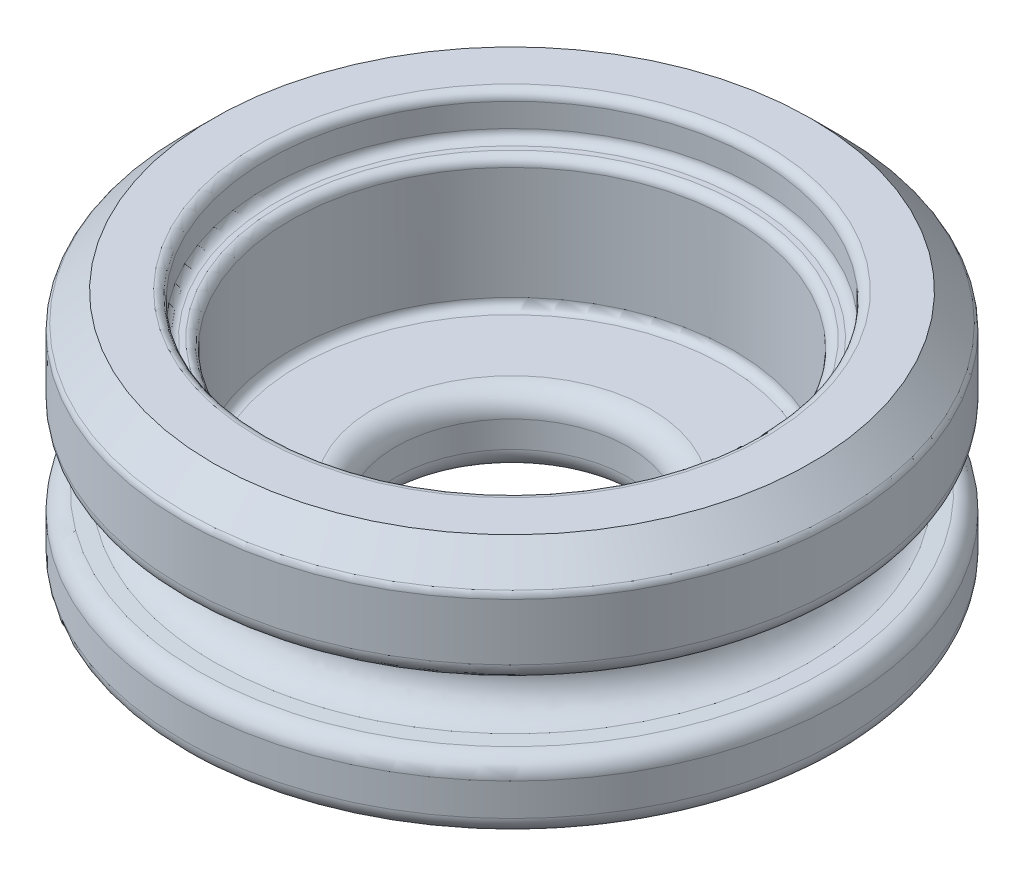
ISO-10303-21;
HEADER;
FILE_DESCRIPTION(('STEP AP214'),'2;1');
FILE_NAME('part.step','',(''),(''),'','','');
FILE_SCHEMA(('AUTOMOTIVE_DESIGN { 1 0 10303 214 1 1 1 1 }'));
ENDSEC;
DATA;
#1=APPLICATION_CONTEXT('core data for automotive mechanical design processes');
#2=APPLICATION_PROTOCOL_DEFINITION('international standard','automotive_design',2000,#1);
#3=PRODUCT_CONTEXT('',#1,'mechanical');
#4=PRODUCT('Part','Part','',(#3));
#5=PRODUCT_RELATED_PRODUCT_CATEGORY('part','',(#4));
#6=PRODUCT_DEFINITION_FORMATION('','',#4);
#7=PRODUCT_DEFINITION_CONTEXT('part definition',#1,'design');
#8=PRODUCT_DEFINITION('design','',#6,#7);
#9=PRODUCT_DEFINITION_SHAPE('','',#8);
#10=(LENGTH_UNIT() NAMED_UNIT(*) SI_UNIT(.MILLI.,.METRE.));
#11=(NAMED_UNIT(*) PLANE_ANGLE_UNIT() SI_UNIT($,.RADIAN.));
#12=(NAMED_UNIT(*) SI_UNIT($,.STERADIAN.) SOLID_ANGLE_UNIT());
#13=UNCERTAINTY_MEASURE_WITH_UNIT(LENGTH_MEASURE(1.E-05),#10,'distance_accuracy_value','');
#14=(GEOMETRIC_REPRESENTATION_CONTEXT(3) GLOBAL_UNCERTAINTY_ASSIGNED_CONTEXT((#13)) GLOBAL_UNIT_ASSIGNED_CONTEXT((#10,
#11,#12)) REPRESENTATION_CONTEXT('',''));
#15=CARTESIAN_POINT('',(0.,0.,0.));
#16=DIRECTION('',(0.,0.,1.));
#17=DIRECTION('',(1.,0.,0.));
#18=AXIS2_PLACEMENT_3D('',#15,#16,#17);
#19=CARTESIAN_POINT('',(0.,-18.1401173645597,0.));
#20=DIRECTION('',(0.,1.,0.));
#21=DIRECTION('',(0.,0.,1.));
#22=AXIS2_PLACEMENT_3D('',#19,#20,#21);
#23=CYLINDRICAL_SURFACE('',#22,6.4135);
#24=CARTESIAN_POINT('',(0.,2.286,0.));
#25=DIRECTION('',(0.,-1.,0.));
#26=DIRECTION('',(0.,0.,-1.));
#27=AXIS2_PLACEMENT_3D('',#24,#25,#26);
#28=CIRCLE('',#27,6.4135);
#29=CARTESIAN_POINT('',(0.,2.286,6.4135));
#30=VERTEX_POINT('',#29);
#31=EDGE_CURVE('E11',#30,#30,#28,.T.);
#32=CARTESIAN_POINT('',(0.,5.540375,0.));
#33=DIRECTION('',(0.,1.,0.));
#34=DIRECTION('',(0.,0.,1.));
#35=AXIS2_PLACEMENT_3D('',#32,#33,#34);
#36=CIRCLE('',#35,6.4135);
#37=CARTESIAN_POINT('',(0.,5.540375,6.4135));
#38=VERTEX_POINT('',#37);
#39=EDGE_CURVE('E108',#38,#38,#36,.T.);
#40=CARTESIAN_POINT('',(0.,2.286,6.4135));
#41=CARTESIAN_POINT('',(0.,2.31989973958334,6.4135));
#42=CARTESIAN_POINT('',(0.,2.35379947916667,6.4135));
#43=CARTESIAN_POINT('',(0.,2.42159895833334,6.4135));
#44=CARTESIAN_POINT('',(0.,2.45549869791667,6.4135));
#45=CARTESIAN_POINT('',(0.,2.52329817708334,6.4135));
#46=CARTESIAN_POINT('',(0.,2.55719791666667,6.4135));
#47=CARTESIAN_POINT('',(0.,2.62499739583334,6.4135));
#48=CARTESIAN_POINT('',(0.,2.65889713541667,6.4135));
#49=CARTESIAN_POINT('',(0.,2.72669661458334,6.4135));
#50=CARTESIAN_POINT('',(0.,2.76059635416667,6.4135));
#51=CARTESIAN_POINT('',(0.,2.82839583333334,6.4135));
#52=CARTESIAN_POINT('',(0.,2.86229557291667,6.4135));
#53=CARTESIAN_POINT('',(0.,2.93009505208334,6.4135));
#54=CARTESIAN_POINT('',(0.,2.96399479166667,6.4135));
#55=CARTESIAN_POINT('',(0.,3.03179427083334,6.4135));
#56=CARTESIAN_POINT('',(0.,3.06569401041667,6.4135));
#57=CARTESIAN_POINT('',(0.,3.13349348958334,6.4135));
#58=CARTESIAN_POINT('',(0.,3.16739322916667,6.4135));
#59=CARTESIAN_POINT('',(0.,3.23519270833334,6.4135));
#60=CARTESIAN_POINT('',(0.,3.26909244791667,6.4135));
#61=CARTESIAN_POINT('',(0.,3.33689192708334,6.4135));
#62=CARTESIAN_POINT('',(0.,3.37079166666667,6.4135));
#63=CARTESIAN_POINT('',(0.,3.43859114583334,6.4135));
#64=CARTESIAN_POINT('',(0.,3.47249088541667,6.4135));
#65=CARTESIAN_POINT('',(0.,3.54029036458334,6.4135));
#66=CARTESIAN_POINT('',(0.,3.57419010416667,6.4135));
#67=CARTESIAN_POINT('',(0.,3.64198958333334,6.4135));
#68=CARTESIAN_POINT('',(0.,3.67588932291667,6.4135));
#69=CARTESIAN_POINT('',(0.,3.74368880208334,6.4135));
#70=CARTESIAN_POINT('',(0.,3.77758854166667,6.4135));
#71=CARTESIAN_POINT('',(0.,3.84538802083333,6.4135));
#72=CARTESIAN_POINT('',(0.,3.87928776041667,6.4135));
#73=CARTESIAN_POINT('',(0.,3.94708723958334,6.4135));
#74=CARTESIAN_POINT('',(0.,3.98098697916667,6.4135));
#75=CARTESIAN_POINT('',(0.,4.04878645833334,6.4135));
#76=CARTESIAN_POINT('',(0.,4.08268619791667,6.4135));
#77=CARTESIAN_POINT('',(0.,4.15048567708333,6.4135));
#78=CARTESIAN_POINT('',(0.,4.18438541666667,6.4135));
#79=CARTESIAN_POINT('',(0.,4.25218489583333,6.4135));
#80=CARTESIAN_POINT('',(0.,4.28608463541667,6.4135));
#81=CARTESIAN_POINT('',(0.,4.35388411458334,6.4135));
#82=CARTESIAN_POINT('',(0.,4.38778385416667,6.4135));
#83=CARTESIAN_POINT('',(0.,4.45558333333334,6.4135));
#84=CARTESIAN_POINT('',(0.,4.48948307291667,6.4135));
#85=CARTESIAN_POINT('',(0.,4.55728255208333,6.4135));
#86=CARTESIAN_POINT('',(0.,4.59118229166667,6.4135));
#87=CARTESIAN_POINT('',(0.,4.65898177083333,6.4135));
#88=CARTESIAN_POINT('',(0.,4.69288151041667,6.4135));
#89=CARTESIAN_POINT('',(0.,4.76068098958333,6.4135));
#90=CARTESIAN_POINT('',(0.,4.79458072916667,6.4135));
#91=CARTESIAN_POINT('',(0.,4.86238020833333,6.4135));
#92=CARTESIAN_POINT('',(0.,4.89627994791667,6.4135));
#93=CARTESIAN_POINT('',(0.,4.96407942708333,6.4135));
#94=CARTESIAN_POINT('',(0.,4.99797916666667,6.4135));
#95=CARTESIAN_POINT('',(0.,5.06577864583333,6.4135));
#96=CARTESIAN_POINT('',(0.,5.09967838541667,6.4135));
#97=CARTESIAN_POINT('',(0.,5.16747786458333,6.4135));
#98=CARTESIAN_POINT('',(0.,5.20137760416667,6.4135));
#99=CARTESIAN_POINT('',(0.,5.26917708333333,6.4135));
#100=CARTESIAN_POINT('',(0.,5.30307682291667,6.4135));
#101=CARTESIAN_POINT('',(0.,5.37087630208333,6.4135));
#102=CARTESIAN_POINT('',(0.,5.40477604166667,6.4135));
#103=CARTESIAN_POINT('',(0.,5.47257552083333,6.4135));
#104=CARTESIAN_POINT('',(0.,5.50647526041667,6.4135));
#105=CARTESIAN_POINT('',(0.,5.540375,6.4135));
#106=B_SPLINE_CURVE_WITH_KNOTS('',3,(#40,#41,#42,#43,#44,#45,#46,#47,#48,#49,#50,#51,#52,#53,
#54,#55,#56,#57,#58,#59,#60,#61,#62,#63,#64,#65,#66,#67,#68,#69,#70,#71,#72,#73,#74,#75,#76,#77,
#78,#79,#80,#81,#82,#83,#84,#85,#86,#87,#88,#89,#90,#91,#92,#93,#94,#95,#96,#97,#98,#99,#100,
#101,#102,#103,#104,#105),.UNSPECIFIED.,.F.,.F.,(4,2,2,2,2,2,2,2,2,2,2,2,2,2,2,2,2,2,2,2,2,2,2,
2,2,2,2,2,2,2,2,2,4),(0.,0.101699218750001,0.203398437499999,0.30509765625,0.406796875000001,
0.508496093749998,0.610195312499999,0.71189453125,0.813593750000001,0.915292968749998,
1.0169921875,1.11869140625,1.220390625,1.32208984375,1.4237890625,1.52548828125,1.6271875,
1.72888671875,1.8305859375,1.93228515625,2.033984375,2.13568359375,2.2373828125,2.33908203125,
2.44078125,2.54248046875,2.6441796875,2.74587890625,2.847578125,2.94927734375,3.0509765625,
3.15267578125,3.254375),.UNSPECIFIED.);
#107=EDGE_CURVE('BSEAM40',#30,#38,#106,.T.);
#108=ORIENTED_EDGE('',*,*,#31,.T.);
#109=ORIENTED_EDGE('',*,*,#39,.T.);
#110=ORIENTED_EDGE('',*,*,#107,.T.);
#111=ORIENTED_EDGE('',*,*,#107,.F.);
#112=EDGE_LOOP('',(#108,#110,#109,#111));
#113=FACE_BOUND('',#112,.T.);
#114=ADVANCED_FACE('F40',(#113),#23,.F.);
#115=CARTESIAN_POINT('',(0.,6.985,0.));
#116=DIRECTION('',(0.,-1.,0.));
#117=DIRECTION('',(0.,0.,-1.));
#118=AXIS2_PLACEMENT_3D('',#115,#116,#117);
#119=CYLINDRICAL_SURFACE('',#118,9.525);
#120=CARTESIAN_POINT('',(0.,5.99078975515723,0.));
#121=DIRECTION('',(0.,1.,0.));
#122=DIRECTION('',(0.,0.,1.));
#123=AXIS2_PLACEMENT_3D('',#120,#121,#122);
#124=CIRCLE('',#123,9.525);
#125=CARTESIAN_POINT('',(0.,5.99078975515723,9.525));
#126=VERTEX_POINT('',#125);
#127=EDGE_CURVE('E132',#126,#126,#124,.F.);
#128=ORIENTED_EDGE('',*,*,#127,.T.);
#129=EDGE_LOOP('',(#128));
#130=FACE_BOUND('',#129,.T.);
#131=CARTESIAN_POINT('',(0.,4.35338149382732,0.));
#132=DIRECTION('',(0.,-1.,0.));
#133=DIRECTION('',(0.,0.,-1.));
#134=AXIS2_PLACEMENT_3D('',#131,#132,#133);
#135=CIRCLE('',#134,9.525);
#136=CARTESIAN_POINT('',(0.802991569326941,4.35338149382732,9.49109211521993));
#137=VERTEX_POINT('',#136);
#138=EDGE_CURVE('E111',#137,#137,#135,.F.);
#139=ORIENTED_EDGE('',*,*,#138,.T.);
#140=EDGE_LOOP('',(#139));
#141=FACE_BOUND('',#140,.T.);
#142=ADVANCED_FACE('F165',(#130,#141),#119,.T.);
#143=CARTESIAN_POINT('',(0.,1.44536115566649,0.));
#144=DIRECTION('',(0.,-1.,0.));
#145=DIRECTION('',(0.,0.,-1.));
#146=AXIS2_PLACEMENT_3D('',#143,#144,#145);
#147=CIRCLE('',#146,9.525);
#148=CARTESIAN_POINT('',(0.802597957528907,1.44536115566649,9.49112540843131));
#149=VERTEX_POINT('',#148);
#150=EDGE_CURVE('E121',#149,#149,#147,.T.);
#151=ORIENTED_EDGE('',*,*,#150,.T.);
#152=EDGE_LOOP('',(#151));
#153=FACE_BOUND('',#152,.T.);
#154=CARTESIAN_POINT('',(0.,0.508,0.));
#155=DIRECTION('',(0.,1.,0.));
#156=DIRECTION('',(0.,0.,1.));
#157=AXIS2_PLACEMENT_3D('',#154,#155,#156);
#158=CIRCLE('',#157,9.525);
#159=CARTESIAN_POINT('',(0.,0.508,9.525));
#160=VERTEX_POINT('',#159);
#161=EDGE_CURVE('E118',#160,#160,#158,.T.);
#162=ORIENTED_EDGE('',*,*,#161,.T.);
#163=EDGE_LOOP('',(#162));
#164=FACE_BOUND('',#163,.T.);
#165=ADVANCED_FACE('F171',(#153,#164),#119,.T.);
#166=CARTESIAN_POINT('',(0.,6.985,0.));
#167=DIRECTION('',(0.,1.,0.));
#168=DIRECTION('',(0.,0.,1.));
#169=AXIS2_PLACEMENT_3D('',#166,#167,#168);
#170=PLANE('',#169);
#171=CARTESIAN_POINT('',(0.,6.985,0.));
#172=DIRECTION('',(0.,1.,0.));
#173=DIRECTION('',(0.,0.,1.));
#174=AXIS2_PLACEMENT_3D('',#171,#172,#173);
#175=CIRCLE('',#174,8.636);
#176=CARTESIAN_POINT('',(0.,6.985,8.636));
#177=VERTEX_POINT('',#176);
#178=EDGE_CURVE('E127',#177,#177,#175,.T.);
#179=ORIENTED_EDGE('',*,*,#178,.T.);
#180=EDGE_LOOP('',(#179));
#181=FACE_BOUND('',#180,.T.);
#182=CARTESIAN_POINT('',(0.,6.985,0.));
#183=DIRECTION('',(0.,1.,0.));
#184=DIRECTION('',(0.,0.,1.));
#185=AXIS2_PLACEMENT_3D('',#182,#183,#184);
#186=CIRCLE('',#185,7.3263125);
#187=CARTESIAN_POINT('',(0.,6.985,7.3263125));
#188=VERTEX_POINT('',#187);
#189=EDGE_CURVE('E99',#188,#188,#186,.F.);
#190=ORIENTED_EDGE('',*,*,#189,.T.);
#191=EDGE_LOOP('',(#190));
#192=FACE_BOUND('',#191,.T.);
#193=ADVANCED_FACE('F179',(#181,#192),#170,.T.);
#194=CARTESIAN_POINT('',(0.,0.,0.));
#195=DIRECTION('',(0.,1.,0.));
#196=DIRECTION('',(0.,0.,1.));
#197=AXIS2_PLACEMENT_3D('',#194,#195,#196);
#198=PLANE('',#197);
#199=CARTESIAN_POINT('',(0.,0.,0.));
#200=DIRECTION('',(0.,1.,0.));
#201=DIRECTION('',(0.,0.,1.));
#202=AXIS2_PLACEMENT_3D('',#199,#200,#201);
#203=CIRCLE('',#202,4.0005);
#204=CARTESIAN_POINT('',(0.,0.,4.0005));
#205=VERTEX_POINT('',#204);
#206=EDGE_CURVE('E147',#205,#205,#203,.T.);
#207=ORIENTED_EDGE('',*,*,#206,.T.);
#208=EDGE_LOOP('',(#207));
#209=FACE_BOUND('',#208,.T.);
#210=CARTESIAN_POINT('',(0.,0.,0.));
#211=DIRECTION('',(0.,1.,0.));
#212=DIRECTION('',(0.,0.,1.));
#213=AXIS2_PLACEMENT_3D('',#210,#211,#212);
#214=CIRCLE('',#213,9.017);
#215=CARTESIAN_POINT('',(0.,0.,9.017));
#216=VERTEX_POINT('',#215);
#217=EDGE_CURVE('E124',#216,#216,#214,.F.);
#218=ORIENTED_EDGE('',*,*,#217,.T.);
#219=EDGE_LOOP('',(#218));
#220=FACE_BOUND('',#219,.T.);
#221=ADVANCED_FACE('F182',(#209,#220),#198,.F.);
#222=CARTESIAN_POINT('',(0.,5.794375,0.));
#223=DIRECTION('',(0.,1.,0.));
#224=DIRECTION('',(0.,0.,1.));
#225=AXIS2_PLACEMENT_3D('',#222,#223,#224);
#226=PLANE('',#225);
#227=CARTESIAN_POINT('',(0.,5.794375,0.));
#228=DIRECTION('',(0.,1.,0.));
#229=DIRECTION('',(0.,0.,1.));
#230=AXIS2_PLACEMENT_3D('',#227,#228,#229);
#231=CIRCLE('',#230,6.8183125);
#232=CARTESIAN_POINT('',(0.,5.794375,6.8183125));
#233=VERTEX_POINT('',#232);
#234=EDGE_CURVE('E105',#233,#233,#231,.T.);
#235=ORIENTED_EDGE('',*,*,#234,.T.);
#236=EDGE_LOOP('',(#235));
#237=FACE_BOUND('',#236,.T.);
#238=CARTESIAN_POINT('',(0.,5.794375,0.));
#239=DIRECTION('',(0.,1.,0.));
#240=DIRECTION('',(0.,0.,1.));
#241=AXIS2_PLACEMENT_3D('',#238,#239,#240);
#242=CIRCLE('',#241,6.6675);
#243=CARTESIAN_POINT('',(0.,5.794375,6.6675));
#244=VERTEX_POINT('',#243);
#245=EDGE_CURVE('E102',#244,#244,#242,.F.);
#246=ORIENTED_EDGE('',*,*,#245,.T.);
#247=EDGE_LOOP('',(#246));
#248=FACE_BOUND('',#247,.T.);
#249=ADVANCED_FACE('F185',(#237,#248),#226,.T.);
#250=CARTESIAN_POINT('',(0.,5.794375,0.));
#251=DIRECTION('',(0.,1.,0.));
#252=DIRECTION('',(0.,0.,1.));
#253=AXIS2_PLACEMENT_3D('',#250,#251,#252);
#254=CYLINDRICAL_SURFACE('',#253,7.0723125);
#255=CARTESIAN_POINT('',(0.,6.731,0.));
#256=DIRECTION('',(0.,1.,0.));
#257=DIRECTION('',(0.,0.,1.));
#258=AXIS2_PLACEMENT_3D('',#255,#256,#257);
#259=CIRCLE('',#258,7.0723125);
#260=CARTESIAN_POINT('',(0.,6.731,7.0723125));
#261=VERTEX_POINT('',#260);
#262=EDGE_CURVE('E96',#261,#261,#259,.T.);
#263=CARTESIAN_POINT('',(0.,6.048375,0.));
#264=DIRECTION('',(0.,1.,0.));
#265=DIRECTION('',(0.,0.,1.));
#266=AXIS2_PLACEMENT_3D('',#263,#264,#265);
#267=CIRCLE('',#266,7.0723125);
#268=CARTESIAN_POINT('',(0.,6.048375,7.0723125));
#269=VERTEX_POINT('',#268);
#270=EDGE_CURVE('E88',#269,#269,#267,.F.);
#271=CARTESIAN_POINT('',(0.,6.731,7.0723125));
#272=CARTESIAN_POINT('',(0.,6.72388932291667,7.0723125));
#273=CARTESIAN_POINT('',(0.,6.71677864583333,7.0723125));
#274=CARTESIAN_POINT('',(0.,6.70255729166667,7.0723125));
#275=CARTESIAN_POINT('',(0.,6.69544661458333,7.0723125));
#276=CARTESIAN_POINT('',(0.,6.68122526041667,7.0723125));
#277=CARTESIAN_POINT('',(0.,6.67411458333333,7.0723125));
#278=CARTESIAN_POINT('',(0.,6.65989322916667,7.0723125));
#279=CARTESIAN_POINT('',(0.,6.65278255208333,7.0723125));
#280=CARTESIAN_POINT('',(0.,6.63856119791667,7.0723125));
#281=CARTESIAN_POINT('',(0.,6.63145052083333,7.0723125));
#282=CARTESIAN_POINT('',(0.,6.61722916666667,7.0723125));
#283=CARTESIAN_POINT('',(0.,6.61011848958333,7.0723125));
#284=CARTESIAN_POINT('',(0.,6.59589713541667,7.0723125));
#285=CARTESIAN_POINT('',(0.,6.58878645833333,7.0723125));
#286=CARTESIAN_POINT('',(0.,6.57456510416667,7.0723125));
#287=CARTESIAN_POINT('',(0.,6.56745442708333,7.0723125));
#288=CARTESIAN_POINT('',(0.,6.55323307291667,7.0723125));
#289=CARTESIAN_POINT('',(0.,6.54612239583333,7.0723125));
#290=CARTESIAN_POINT('',(0.,6.53190104166667,7.0723125));
#291=CARTESIAN_POINT('',(0.,6.52479036458333,7.0723125));
#292=CARTESIAN_POINT('',(0.,6.51056901041667,7.0723125));
#293=CARTESIAN_POINT('',(0.,6.50345833333333,7.0723125));
#294=CARTESIAN_POINT('',(0.,6.48923697916667,7.0723125));
#295=CARTESIAN_POINT('',(0.,6.48212630208333,7.0723125));
#296=CARTESIAN_POINT('',(0.,6.46790494791667,7.0723125));
#297=CARTESIAN_POINT('',(0.,6.46079427083333,7.0723125));
#298=CARTESIAN_POINT('',(0.,6.44657291666667,7.0723125));
#299=CARTESIAN_POINT('',(0.,6.43946223958333,7.0723125));
#300=CARTESIAN_POINT('',(0.,6.42524088541667,7.0723125));
#301=CARTESIAN_POINT('',(0.,6.41813020833333,7.0723125));
#302=CARTESIAN_POINT('',(0.,6.40390885416667,7.0723125));
#303=CARTESIAN_POINT('',(0.,6.39679817708333,7.0723125));
#304=CARTESIAN_POINT('',(0.,6.38257682291667,7.0723125));
#305=CARTESIAN_POINT('',(0.,6.37546614583333,7.0723125));
#306=CARTESIAN_POINT('',(0.,6.36124479166667,7.0723125));
#307=CARTESIAN_POINT('',(0.,6.35413411458333,7.0723125));
#308=CARTESIAN_POINT('',(0.,6.33991276041667,7.0723125));
#309=CARTESIAN_POINT('',(0.,6.33280208333333,7.0723125));
#310=CARTESIAN_POINT('',(0.,6.31858072916667,7.0723125));
#311=CARTESIAN_POINT('',(0.,6.31147005208333,7.0723125));
#312=CARTESIAN_POINT('',(0.,6.29724869791667,7.0723125));
#313=CARTESIAN_POINT('',(0.,6.29013802083333,7.0723125));
#314=CARTESIAN_POINT('',(0.,6.27591666666667,7.0723125));
#315=CARTESIAN_POINT('',(0.,6.26880598958333,7.0723125));
#316=CARTESIAN_POINT('',(0.,6.25458463541667,7.0723125));
#317=CARTESIAN_POINT('',(0.,6.24747395833333,7.0723125));
#318=CARTESIAN_POINT('',(0.,6.23325260416667,7.0723125));
#319=CARTESIAN_POINT('',(0.,6.22614192708333,7.0723125));
#320=CARTESIAN_POINT('',(0.,6.21192057291667,7.0723125));
#321=CARTESIAN_POINT('',(0.,6.20480989583333,7.0723125));
#322=CARTESIAN_POINT('',(0.,6.19058854166667,7.0723125));
#323=CARTESIAN_POINT('',(0.,6.18347786458333,7.0723125));
#324=CARTESIAN_POINT('',(0.,6.16925651041667,7.0723125));
#325=CARTESIAN_POINT('',(0.,6.16214583333333,7.0723125));
#326=CARTESIAN_POINT('',(0.,6.14792447916667,7.0723125));
#327=CARTESIAN_POINT('',(0.,6.14081380208333,7.0723125));
#328=CARTESIAN_POINT('',(0.,6.12659244791667,7.0723125));
#329=CARTESIAN_POINT('',(0.,6.11948177083333,7.0723125));
#330=CARTESIAN_POINT('',(0.,6.10526041666667,7.0723125));
#331=CARTESIAN_POINT('',(0.,6.09814973958333,7.0723125));
#332=CARTESIAN_POINT('',(0.,6.08392838541667,7.0723125));
#333=CARTESIAN_POINT('',(0.,6.07681770833333,7.0723125));
#334=CARTESIAN_POINT('',(0.,6.06259635416667,7.0723125));
#335=CARTESIAN_POINT('',(0.,6.05548567708333,7.0723125));
#336=CARTESIAN_POINT('',(0.,6.048375,7.0723125));
#337=B_SPLINE_CURVE_WITH_KNOTS('',3,(#271,#272,#273,#274,#275,#276,#277,#278,#279,#280,#281,
#282,#283,#284,#285,#286,#287,#288,#289,#290,#291,#292,#293,#294,#295,#296,#297,#298,#299,#300,
#301,#302,#303,#304,#305,#306,#307,#308,#309,#310,#311,#312,#313,#314,#315,#316,#317,#318,#319,
#320,#321,#322,#323,#324,#325,#326,#327,#328,#329,#330,#331,#332,#333,#334,#335,#336),
.UNSPECIFIED.,.F.,.F.,(4,2,2,2,2,2,2,2,2,2,2,2,2,2,2,2,2,2,2,2,2,2,2,2,2,2,2,2,2,2,2,2,4),(0.,
0.0213320312499998,0.0426640624999995,0.0639960937500001,0.0853281249999999,0.10666015625,
0.127992187499999,0.14932421875,0.17065625,0.19198828125,0.213320312499999,0.23465234375,
0.255984375,0.277316406249999,0.298648437499999,0.31998046875,0.3413125,0.362644531249999,
0.3839765625,0.40530859375,0.426640624999999,0.447972656249999,0.4693046875,0.49063671875,
0.511968749999999,0.533300781249999,0.5546328125,0.57596484375,0.597296874999999,0.61862890625,
0.6399609375,0.661292968749999,0.682624999999999),.UNSPECIFIED.);
#338=EDGE_CURVE('BSEAM177',#261,#269,#337,.T.);
#339=ORIENTED_EDGE('',*,*,#262,.T.);
#340=ORIENTED_EDGE('',*,*,#270,.T.);
#341=ORIENTED_EDGE('',*,*,#338,.T.);
#342=ORIENTED_EDGE('',*,*,#338,.F.);
#343=EDGE_LOOP('',(#339,#341,#340,#342));
#344=FACE_BOUND('',#343,.T.);
#345=ADVANCED_FACE('F177',(#344),#254,.F.);
#346=CARTESIAN_POINT('',(0.760529971451931,3.84160667122113,8.54210164457974));
#347=CARTESIAN_POINT('',(17.8447332606114,3.84160667122113,7.02104170167588));
#348=CARTESIAN_POINT('',(16.3236733177075,3.84160667122113,-10.0631615874836));
#349=CARTESIAN_POINT('',(-0.760529971451931,3.84160667122113,-8.54210164457974));
#350=CARTESIAN_POINT('',(-17.8447332606114,3.84160667122113,-7.02104170167588));
#351=CARTESIAN_POINT('',(-16.3236733177075,3.84160667122113,10.0631615874836));
#352=CARTESIAN_POINT('',(0.760529971451931,3.84160667122113,8.54210164457974));
#353=CARTESIAN_POINT('',(0.760529971451931,3.8496875,9.49458894120874));
#354=CARTESIAN_POINT('',(19.7497078538694,3.8496875,7.97352899830488));
#355=CARTESIAN_POINT('',(18.2286479109656,3.8496875,-11.0156488841126));
#356=CARTESIAN_POINT('',(-0.760529971451931,3.8496875,-9.49458894120874));
#357=CARTESIAN_POINT('',(-19.7497078538694,3.8496875,-7.97352899830488));
#358=CARTESIAN_POINT('',(-18.2286479109656,3.8496875,11.0156488841126));
#359=CARTESIAN_POINT('',(0.760529971451931,3.8496875,9.49458894120874));
#360=(BOUNDED_SURFACE() B_SPLINE_SURFACE(1,3,((#346,#347,#348,#349,#350,#351,#352),(#353,#354,
#355,#356,#357,#358,#359)),.UNSPECIFIED.,.F.,.T.,.F.) B_SPLINE_SURFACE_WITH_KNOTS((2,2),(4,3,4),
(0.,1.),(0.,0.5,1.),
.UNSPECIFIED.) GEOMETRIC_REPRESENTATION_ITEM() RATIONAL_B_SPLINE_SURFACE(((1.,0.333333333333333,
0.333333333333333,1.,0.333333333333333,0.333333333333333,1.),(1.,0.333333333333333,
0.333333333333333,1.,0.333333333333333,0.333333333333333,1.))) REPRESENTATION_ITEM('') SURFACE());
#361=DIRECTION('',(0.,0.0084836175836416,0.999964013468832));
#362=VECTOR('',#361,1.);
#363=CARTESIAN_POINT('',(0.760529971451931,3.84160667122113,8.54210164457974));
#364=LINE('',#363,#362);
#365=CARTESIAN_POINT('',(0.760529971451931,3.84160667122113,8.54210164457973));
#366=VERTEX_POINT('',#365);
#367=CARTESIAN_POINT('',(0.760529971451931,3.84539990583393,8.98921021236391));
#368=VERTEX_POINT('',#367);
#369=EDGE_CURVE('E86',#366,#368,#364,.T.);
#370=CARTESIAN_POINT('',(0.,3.84539990583393,0.));
#371=DIRECTION('',(0.,1.,0.));
#372=DIRECTION('',(0.,0.,1.));
#373=AXIS2_PLACEMENT_3D('',#370,#371,#372);
#374=CIRCLE('',#373,9.02132507337721);
#375=EDGE_CURVE('E114',#368,#368,#374,.F.);
#376=CARTESIAN_POINT('',(0.,3.84160667122113,0.));
#377=DIRECTION('',(0.,1.,0.));
#378=DIRECTION('',(0.0886823272321617,0.,0.996059960462566));
#379=AXIS2_PLACEMENT_3D('',#376,#377,#378);
#380=CIRCLE('',#379,8.57589099416547);
#381=EDGE_CURVE('E85',#366,#366,#380,.T.);
#382=ORIENTED_EDGE('',*,*,#369,.T.);
#383=ORIENTED_EDGE('',*,*,#375,.T.);
#384=ORIENTED_EDGE('',*,*,#369,.F.);
#385=ORIENTED_EDGE('',*,*,#381,.T.);
#386=EDGE_LOOP('',(#382,#383,#384,#385));
#387=FACE_BOUND('',#386,.T.);
#388=ADVANCED_FACE('F253',(#387),#360,.F.);
#389=CARTESIAN_POINT('',(0.760529971451931,1.96103635974386,8.54210164457974));
#390=CARTESIAN_POINT('',(17.8447332606114,1.96103635974386,7.02104170167588));
#391=CARTESIAN_POINT('',(16.3236733177075,1.96103635974386,-10.0631615874836));
#392=CARTESIAN_POINT('',(-0.760529971451931,1.96103635974386,-8.54210164457974));
#393=CARTESIAN_POINT('',(-17.8447332606114,1.96103635974386,-7.02104170167588));
#394=CARTESIAN_POINT('',(-16.3236733177075,1.96103635974386,10.0631615874836));
#395=CARTESIAN_POINT('',(0.760529971451931,1.96103635974386,8.54210164457974));
#396=CARTESIAN_POINT('',(0.760529971451931,2.18859072060016,7.1349201506886));
#397=CARTESIAN_POINT('',(15.0303702728291,2.18859072060016,5.61386020778474));
#398=CARTESIAN_POINT('',(13.5093103299253,2.18859072060016,-8.65598009359246));
#399=CARTESIAN_POINT('',(-0.760529971451931,2.18859072060016,-7.1349201506886));
#400=CARTESIAN_POINT('',(-15.0303702728291,2.18859072060016,-5.61386020778474));
#401=CARTESIAN_POINT('',(-13.5093103299253,2.18859072060016,8.65598009359246));
#402=CARTESIAN_POINT('',(0.760529971451931,2.18859072060016,7.1349201506886));
#403=CARTESIAN_POINT('',(0.760529971451931,3.61405231036483,7.1349201506886));
#404=CARTESIAN_POINT('',(15.0303702728291,3.61405231036483,5.61386020778474));
#405=CARTESIAN_POINT('',(13.5093103299253,3.61405231036483,-8.65598009359246));
#406=CARTESIAN_POINT('',(-0.760529971451931,3.61405231036483,-7.1349201506886));
#407=CARTESIAN_POINT('',(-15.0303702728291,3.61405231036483,-5.61386020778474));
#408=CARTESIAN_POINT('',(-13.5093103299253,3.61405231036483,8.65598009359246));
#409=CARTESIAN_POINT('',(0.760529971451931,3.61405231036483,7.1349201506886));
#410=CARTESIAN_POINT('',(0.760529971451931,3.84160667122113,8.54210164457974));
#411=CARTESIAN_POINT('',(17.8447332606114,3.84160667122113,7.02104170167588));
#412=CARTESIAN_POINT('',(16.3236733177075,3.84160667122113,-10.0631615874836));
#413=CARTESIAN_POINT('',(-0.760529971451931,3.84160667122113,-8.54210164457974));
#414=CARTESIAN_POINT('',(-17.8447332606114,3.84160667122113,-7.02104170167588));
#415=CARTESIAN_POINT('',(-16.3236733177075,3.84160667122113,10.0631615874836));
#416=CARTESIAN_POINT('',(0.760529971451931,3.84160667122113,8.54210164457974));
#417=(BOUNDED_SURFACE() B_SPLINE_SURFACE(3,3,((#389,#390,#391,#392,#393,#394,#395),(#396,#397,
#398,#399,#400,#401,#402),(#403,#404,#405,#406,#407,#408,#409),(#410,#411,#412,#413,#414,#415,
#416)),.UNSPECIFIED.,.F.,.T.,.F.) B_SPLINE_SURFACE_WITH_KNOTS((4,4),(4,3,4),(0.,1.),(0.,0.5,1.),
.UNSPECIFIED.) GEOMETRIC_REPRESENTATION_ITEM() RATIONAL_B_SPLINE_SURFACE(((1.,0.333333333333333,
0.333333333333333,1.,0.333333333333333,0.333333333333333,1.),(0.439757040802419,
0.146585680267473,0.146585680267473,0.439757040802419,0.146585680267473,0.146585680267473,
0.439757040802419),(0.439757040802419,0.146585680267473,0.146585680267473,0.439757040802419,
0.146585680267473,0.146585680267473,0.439757040802419),(1.,0.333333333333333,0.333333333333333,
1.,0.333333333333333,0.333333333333333,1.))) REPRESENTATION_ITEM('') SURFACE());
#418=CARTESIAN_POINT('',(0.760529971451931,2.90132151548249,8.69415451662619));
#419=DIRECTION('',(1.,0.,0.));
#420=DIRECTION('',(0.,0.,-1.));
#421=AXIS2_PLACEMENT_3D('',#418,#419,#420);
#422=CIRCLE('',#421,0.9525);
#423=CARTESIAN_POINT('',(0.760529971451931,1.96103635974386,8.54210164457973));
#424=VERTEX_POINT('',#423);
#425=EDGE_CURVE('E78',#424,#366,#422,.T.);
#426=CARTESIAN_POINT('',(0.,1.96103635974386,0.));
#427=DIRECTION('',(0.,1.,0.));
#428=DIRECTION('',(0.0886823272321617,0.,0.996059960462566));
#429=AXIS2_PLACEMENT_3D('',#426,#427,#428);
#430=CIRCLE('',#429,8.57589099416547);
#431=EDGE_CURVE('E75',#424,#424,#430,.T.);
#432=ORIENTED_EDGE('',*,*,#425,.T.);
#433=ORIENTED_EDGE('',*,*,#381,.F.);
#434=ORIENTED_EDGE('',*,*,#425,.F.);
#435=ORIENTED_EDGE('',*,*,#431,.T.);
#436=EDGE_LOOP('',(#432,#433,#434,#435));
#437=FACE_BOUND('',#436,.T.);
#438=ADVANCED_FACE('F83',(#437),#417,.F.);
#439=CARTESIAN_POINT('',(0.760529971451931,1.9446875,9.49458894120874));
#440=CARTESIAN_POINT('',(19.7497078538694,1.9446875,7.97352899830488));
#441=CARTESIAN_POINT('',(18.2286479109656,1.9446875,-11.0156488841126));
#442=CARTESIAN_POINT('',(-0.760529971451931,1.9446875,-9.49458894120874));
#443=CARTESIAN_POINT('',(-19.7497078538694,1.9446875,-7.97352899830488));
#444=CARTESIAN_POINT('',(-18.2286479109656,1.9446875,11.0156488841126));
#445=CARTESIAN_POINT('',(0.760529971451931,1.9446875,9.49458894120874));
#446=CARTESIAN_POINT('',(0.760529971451931,1.96103635974386,8.54210164457974));
#447=CARTESIAN_POINT('',(17.8447332606114,1.96103635974386,7.02104170167588));
#448=CARTESIAN_POINT('',(16.3236733177075,1.96103635974386,-10.0631615874836));
#449=CARTESIAN_POINT('',(-0.760529971451931,1.96103635974386,-8.54210164457974));
#450=CARTESIAN_POINT('',(-17.8447332606114,1.96103635974386,-7.02104170167588));
#451=CARTESIAN_POINT('',(-16.3236733177075,1.96103635974386,10.0631615874836));
#452=CARTESIAN_POINT('',(0.760529971451931,1.96103635974386,8.54210164457974));
#453=(BOUNDED_SURFACE() B_SPLINE_SURFACE(1,3,((#439,#440,#441,#442,#443,#444,#445),(#446,#447,
#448,#449,#450,#451,#452)),.UNSPECIFIED.,.F.,.T.,.F.) B_SPLINE_SURFACE_WITH_KNOTS((2,2),(4,3,4),
(0.,1.),(0.,0.5,1.),
.UNSPECIFIED.) GEOMETRIC_REPRESENTATION_ITEM() RATIONAL_B_SPLINE_SURFACE(((1.,0.333333333333333,
0.333333333333333,1.,0.333333333333333,0.333333333333333,1.),(1.,0.333333333333333,
0.333333333333333,1.,0.333333333333333,0.333333333333333,1.))) REPRESENTATION_ITEM('') SURFACE());
#454=DIRECTION('',(0.,0.0171618582364967,-0.999852724465894));
#455=VECTOR('',#454,1.);
#456=CARTESIAN_POINT('',(0.760529971451931,1.9446875,9.49458894120874));
#457=LINE('',#456,#455);
#458=CARTESIAN_POINT('',(0.760529971451931,1.95328580481269,8.99365026811818));
#459=VERTEX_POINT('',#458);
#460=EDGE_CURVE('E72',#459,#424,#457,.T.);
#461=CARTESIAN_POINT('',(0.,1.95328580481269,0.));
#462=DIRECTION('',(0.,1.,0.));
#463=DIRECTION('',(0.,0.,1.));
#464=AXIS2_PLACEMENT_3D('',#461,#462,#463);
#465=CIRCLE('',#464,9.02574933081453);
#466=EDGE_CURVE('E77',#459,#459,#465,.T.);
#467=ORIENTED_EDGE('',*,*,#460,.F.);
#468=ORIENTED_EDGE('',*,*,#466,.T.);
#469=ORIENTED_EDGE('',*,*,#460,.T.);
#470=ORIENTED_EDGE('',*,*,#431,.F.);
#471=EDGE_LOOP('',(#467,#468,#469,#470));
#472=FACE_BOUND('',#471,.T.);
#473=ADVANCED_FACE('F74',(#472),#453,.F.);
#474=CARTESIAN_POINT('',(0.,2.032,0.));
#475=DIRECTION('',(0.,-1.,0.));
#476=DIRECTION('',(0.,0.,-1.));
#477=AXIS2_PLACEMENT_3D('',#474,#475,#476);
#478=PLANE('',#477);
#479=CARTESIAN_POINT('',(0.,2.032,0.));
#480=DIRECTION('',(0.,-1.,0.));
#481=DIRECTION('',(0.,0.,-1.));
#482=AXIS2_PLACEMENT_3D('',#479,#480,#481);
#483=CIRCLE('',#482,6.1595);
#484=CARTESIAN_POINT('',(0.,2.032,-6.1595));
#485=VERTEX_POINT('',#484);
#486=EDGE_CURVE('E48',#485,#485,#483,.F.);
#487=ORIENTED_EDGE('',*,*,#486,.T.);
#488=EDGE_LOOP('',(#487));
#489=FACE_BOUND('',#488,.T.);
#490=CARTESIAN_POINT('',(0.,2.032,0.));
#491=DIRECTION('',(0.,-1.,0.));
#492=DIRECTION('',(0.,0.,-1.));
#493=AXIS2_PLACEMENT_3D('',#490,#491,#492);
#494=CIRCLE('',#493,4.0005);
#495=CARTESIAN_POINT('',(0.,2.032,-4.0005));
#496=VERTEX_POINT('',#495);
#497=EDGE_CURVE('E138',#496,#496,#494,.T.);
#498=ORIENTED_EDGE('',*,*,#497,.T.);
#499=EDGE_LOOP('',(#498));
#500=FACE_BOUND('',#499,.T.);
#501=ADVANCED_FACE('F152',(#489,#500),#478,.F.);
#502=CARTESIAN_POINT('',(0.,2.032,0.));
#503=DIRECTION('',(0.,-1.,0.));
#504=DIRECTION('',(0.,0.,-1.));
#505=AXIS2_PLACEMENT_3D('',#502,#503,#504);
#506=CYLINDRICAL_SURFACE('',#505,3.3655);
#507=CARTESIAN_POINT('',(0.,1.397,0.));
#508=DIRECTION('',(0.,-1.,0.));
#509=DIRECTION('',(0.,0.,-1.));
#510=AXIS2_PLACEMENT_3D('',#507,#508,#509);
#511=CIRCLE('',#510,3.3655);
#512=CARTESIAN_POINT('',(0.,1.397,-3.3655));
#513=VERTEX_POINT('',#512);
#514=EDGE_CURVE('E144',#513,#513,#511,.F.);
#515=ORIENTED_EDGE('',*,*,#514,.T.);
#516=EDGE_LOOP('',(#515));
#517=FACE_BOUND('',#516,.T.);
#518=CARTESIAN_POINT('',(0.,0.635,0.));
#519=DIRECTION('',(0.,1.,0.));
#520=DIRECTION('',(0.,0.,1.));
#521=AXIS2_PLACEMENT_3D('',#518,#519,#520);
#522=CIRCLE('',#521,3.3655);
#523=CARTESIAN_POINT('',(0.,0.635,3.3655));
#524=VERTEX_POINT('',#523);
#525=EDGE_CURVE('E141',#524,#524,#522,.F.);
#526=ORIENTED_EDGE('',*,*,#525,.T.);
#527=EDGE_LOOP('',(#526));
#528=FACE_BOUND('',#527,.T.);
#529=ADVANCED_FACE('F194',(#517,#528),#506,.F.);
#530=CARTESIAN_POINT('',(0.,6.731,0.));
#531=DIRECTION('',(0.,1.,0.));
#532=DIRECTION('',(0.,0.,1.));
#533=AXIS2_PLACEMENT_3D('',#530,#531,#532);
#534=TOROIDAL_SURFACE('',#533,7.3263125,0.254);
#535=ORIENTED_EDGE('',*,*,#189,.F.);
#536=EDGE_LOOP('',(#535));
#537=FACE_BOUND('',#536,.T.);
#538=ORIENTED_EDGE('',*,*,#262,.F.);
#539=EDGE_LOOP('',(#538));
#540=FACE_BOUND('',#539,.T.);
#541=ADVANCED_FACE('F190',(#537,#540),#534,.T.);
#542=CARTESIAN_POINT('',(0.,6.048375,0.));
#543=DIRECTION('',(0.,1.,0.));
#544=DIRECTION('',(0.,0.,1.));
#545=AXIS2_PLACEMENT_3D('',#542,#543,#544);
#546=TOROIDAL_SURFACE('',#545,6.8183125,0.254);
#547=ORIENTED_EDGE('',*,*,#270,.F.);
#548=EDGE_LOOP('',(#547));
#549=FACE_BOUND('',#548,.T.);
#550=ORIENTED_EDGE('',*,*,#234,.F.);
#551=EDGE_LOOP('',(#550));
#552=FACE_BOUND('',#551,.T.);
#553=ADVANCED_FACE('F193',(#549,#552),#546,.F.);
#554=CARTESIAN_POINT('',(0.,5.540375,0.));
#555=DIRECTION('',(0.,1.,0.));
#556=DIRECTION('',(0.,0.,1.));
#557=AXIS2_PLACEMENT_3D('',#554,#555,#556);
#558=TOROIDAL_SURFACE('',#557,6.6675,0.254);
#559=ORIENTED_EDGE('',*,*,#39,.F.);
#560=EDGE_LOOP('',(#559));
#561=FACE_BOUND('',#560,.T.);
#562=ORIENTED_EDGE('',*,*,#245,.F.);
#563=EDGE_LOOP('',(#562));
#564=FACE_BOUND('',#563,.T.);
#565=ADVANCED_FACE('F198',(#561,#564),#558,.T.);
#566=CARTESIAN_POINT('',(0.,4.35338149382732,0.));
#567=DIRECTION('',(0.,-1.,0.));
#568=DIRECTION('',(0.,0.,-1.));
#569=AXIS2_PLACEMENT_3D('',#566,#567,#568);
#570=TOROIDAL_SURFACE('',#569,9.017,0.508);
#571=CARTESIAN_POINT('',(0.760165352296171,4.35338149382732,8.98490053574153));
#572=DIRECTION('',(-0.996440117083457,0.,0.0843035768322245));
#573=DIRECTION('',(0.0843035768322245,0.,0.996440117083457));
#574=AXIS2_PLACEMENT_3D('',#571,#572,#573);
#575=CIRCLE('',#574,0.508);
#576=EDGE_CURVE('E79',#368,#137,#575,.T.);
#577=ORIENTED_EDGE('',*,*,#576,.F.);
#578=ORIENTED_EDGE('',*,*,#375,.F.);
#579=ORIENTED_EDGE('',*,*,#576,.T.);
#580=ORIENTED_EDGE('',*,*,#138,.F.);
#581=EDGE_LOOP('',(#577,#578,#579,#580));
#582=FACE_BOUND('',#581,.T.);
#583=ADVANCED_FACE('F202',(#582),#570,.T.);
#584=CARTESIAN_POINT('',(0.,1.44536115566649,0.));
#585=DIRECTION('',(0.,-1.,0.));
#586=DIRECTION('',(0.,0.,-1.));
#587=AXIS2_PLACEMENT_3D('',#584,#585,#586);
#588=TOROIDAL_SURFACE('',#587,9.017,0.508);
#589=CARTESIAN_POINT('',(0.759792733127366,1.44536115566649,8.98493205331498));
#590=DIRECTION('',(-0.996443612433734,0.,0.0842622527589404));
#591=DIRECTION('',(0.0842622527589404,0.,0.996443612433734));
#592=AXIS2_PLACEMENT_3D('',#589,#590,#591);
#593=CIRCLE('',#592,0.508);
#594=EDGE_CURVE('E55',#149,#459,#593,.T.);
#595=ORIENTED_EDGE('',*,*,#594,.F.);
#596=ORIENTED_EDGE('',*,*,#150,.F.);
#597=ORIENTED_EDGE('',*,*,#594,.T.);
#598=ORIENTED_EDGE('',*,*,#466,.F.);
#599=EDGE_LOOP('',(#595,#596,#597,#598));
#600=FACE_BOUND('',#599,.T.);
#601=ADVANCED_FACE('F206',(#600),#588,.T.);
#602=CARTESIAN_POINT('',(0.,0.508,0.));
#603=DIRECTION('',(0.,1.,0.));
#604=DIRECTION('',(0.,0.,1.));
#605=AXIS2_PLACEMENT_3D('',#602,#603,#604);
#606=TOROIDAL_SURFACE('',#605,9.017,0.508);
#607=ORIENTED_EDGE('',*,*,#217,.F.);
#608=EDGE_LOOP('',(#607));
#609=FACE_BOUND('',#608,.T.);
#610=ORIENTED_EDGE('',*,*,#161,.F.);
#611=EDGE_LOOP('',(#610));
#612=FACE_BOUND('',#611,.T.);
#613=ADVANCED_FACE('F210',(#609,#612),#606,.T.);
#614=CARTESIAN_POINT('',(0.,6.985,0.));
#615=DIRECTION('',(0.,-1.,0.));
#616=DIRECTION('',(0.,0.,-1.));
#617=AXIS2_PLACEMENT_3D('',#614,#615,#616);
#618=CONICAL_SURFACE('',#617,8.636,0.785398163397445);
#619=CARTESIAN_POINT('',(0.,6.17039487757861,0.));
#620=DIRECTION('',(0.,-1.,0.));
#621=DIRECTION('',(0.,0.,-1.));
#622=AXIS2_PLACEMENT_3D('',#619,#620,#621);
#623=CIRCLE('',#622,9.45060512242138);
#624=CARTESIAN_POINT('',(0.,6.17039487757861,-9.45060512242138));
#625=VERTEX_POINT('',#624);
#626=EDGE_CURVE('E135',#625,#625,#623,.F.);
#627=ORIENTED_EDGE('',*,*,#626,.T.);
#628=EDGE_LOOP('',(#627));
#629=FACE_BOUND('',#628,.T.);
#630=ORIENTED_EDGE('',*,*,#178,.F.);
#631=EDGE_LOOP('',(#630));
#632=FACE_BOUND('',#631,.T.);
#633=ADVANCED_FACE('F213',(#629,#632),#618,.T.);
#634=CARTESIAN_POINT('',(0.,5.99078975515723,0.));
#635=DIRECTION('',(0.,1.,0.));
#636=DIRECTION('',(0.,0.,1.));
#637=AXIS2_PLACEMENT_3D('',#634,#635,#636);
#638=TOROIDAL_SURFACE('',#637,9.271,0.254);
#639=ORIENTED_EDGE('',*,*,#626,.F.);
#640=EDGE_LOOP('',(#639));
#641=FACE_BOUND('',#640,.T.);
#642=ORIENTED_EDGE('',*,*,#127,.F.);
#643=EDGE_LOOP('',(#642));
#644=FACE_BOUND('',#643,.T.);
#645=ADVANCED_FACE('F220',(#641,#644),#638,.T.);
#646=CARTESIAN_POINT('',(0.,1.397,0.));
#647=DIRECTION('',(0.,-1.,0.));
#648=DIRECTION('',(0.,0.,-1.));
#649=AXIS2_PLACEMENT_3D('',#646,#647,#648);
#650=TOROIDAL_SURFACE('',#649,4.0005,0.635);
#651=ORIENTED_EDGE('',*,*,#514,.F.);
#652=EDGE_LOOP('',(#651));
#653=FACE_BOUND('',#652,.T.);
#654=ORIENTED_EDGE('',*,*,#497,.F.);
#655=EDGE_LOOP('',(#654));
#656=FACE_BOUND('',#655,.T.);
#657=ADVANCED_FACE('F161',(#653,#656),#650,.T.);
#658=CARTESIAN_POINT('',(0.,0.635,0.));
#659=DIRECTION('',(0.,1.,0.));
#660=DIRECTION('',(0.,0.,1.));
#661=AXIS2_PLACEMENT_3D('',#658,#659,#660);
#662=TOROIDAL_SURFACE('',#661,4.0005,0.635);
#663=ORIENTED_EDGE('',*,*,#206,.F.);
#664=EDGE_LOOP('',(#663));
#665=FACE_BOUND('',#664,.T.);
#666=ORIENTED_EDGE('',*,*,#525,.F.);
#667=EDGE_LOOP('',(#666));
#668=FACE_BOUND('',#667,.T.);
#669=ADVANCED_FACE('F156',(#665,#668),#662,.T.);
#670=CARTESIAN_POINT('',(0.,2.286,0.));
#671=DIRECTION('',(0.,-1.,0.));
#672=DIRECTION('',(0.,0.,-1.));
#673=AXIS2_PLACEMENT_3D('',#670,#671,#672);
#674=TOROIDAL_SURFACE('',#673,6.1595,0.254);
#675=ORIENTED_EDGE('',*,*,#31,.F.);
#676=EDGE_LOOP('',(#675));
#677=FACE_BOUND('',#676,.T.);
#678=ORIENTED_EDGE('',*,*,#486,.F.);
#679=EDGE_LOOP('',(#678));
#680=FACE_BOUND('',#679,.T.);
#681=ADVANCED_FACE('F42',(#677,#680),#674,.F.);
#682=CLOSED_SHELL('',(#114,#142,#165,#193,#221,#249,#345,#388,#438,#473,#501,#529,#541,#553,
#565,#583,#601,#613,#633,#645,#657,#669,#681));
#683=MANIFOLD_SOLID_BREP('B2',#682);
#684=ADVANCED_BREP_SHAPE_REPRESENTATION('',(#18,#683),#14);
#685=SHAPE_DEFINITION_REPRESENTATION(#9,#684);
ENDSEC;
END-ISO-10303-21;
